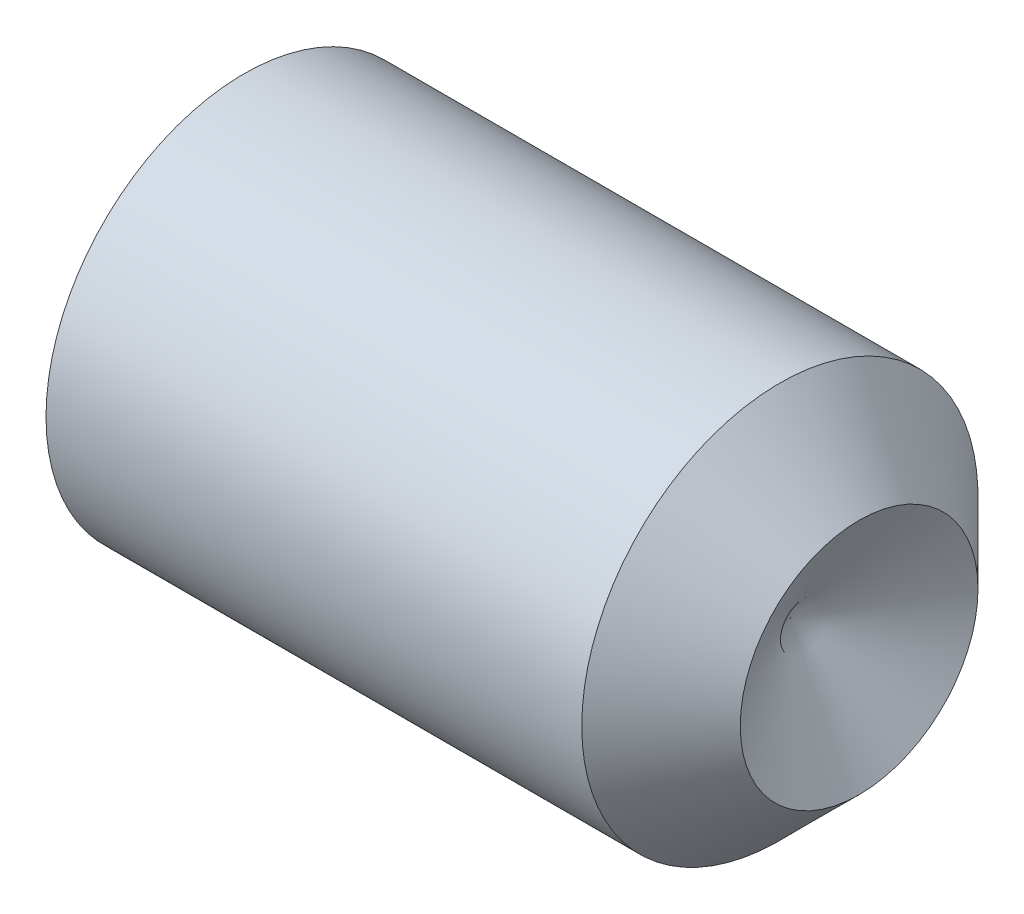
ISO-10303-21;
HEADER;
FILE_DESCRIPTION(('STEP AP214'),'2;1');
FILE_NAME('part.step','',(''),(''),'','','');
FILE_SCHEMA(('AUTOMOTIVE_DESIGN { 1 0 10303 214 1 1 1 1 }'));
ENDSEC;
DATA;
#1=APPLICATION_CONTEXT('core data for automotive mechanical design processes');
#2=APPLICATION_PROTOCOL_DEFINITION('international standard','automotive_design',2000,#1);
#3=PRODUCT_CONTEXT('',#1,'mechanical');
#4=PRODUCT('Part','Part','',(#3));
#5=PRODUCT_RELATED_PRODUCT_CATEGORY('part','',(#4));
#6=PRODUCT_DEFINITION_FORMATION('','',#4);
#7=PRODUCT_DEFINITION_CONTEXT('part definition',#1,'design');
#8=PRODUCT_DEFINITION('design','',#6,#7);
#9=PRODUCT_DEFINITION_SHAPE('','',#8);
#10=(LENGTH_UNIT() NAMED_UNIT(*) SI_UNIT(.MILLI.,.METRE.));
#11=(NAMED_UNIT(*) PLANE_ANGLE_UNIT() SI_UNIT($,.RADIAN.));
#12=(NAMED_UNIT(*) SI_UNIT($,.STERADIAN.) SOLID_ANGLE_UNIT());
#13=UNCERTAINTY_MEASURE_WITH_UNIT(LENGTH_MEASURE(1.E-05),#10,'distance_accuracy_value','');
#14=(GEOMETRIC_REPRESENTATION_CONTEXT(3) GLOBAL_UNCERTAINTY_ASSIGNED_CONTEXT((#13)) GLOBAL_UNIT_ASSIGNED_CONTEXT((#10,
#11,#12)) REPRESENTATION_CONTEXT('',''));
#15=CARTESIAN_POINT('',(0.,0.,0.));
#16=DIRECTION('',(0.,0.,1.));
#17=DIRECTION('',(1.,0.,0.));
#18=AXIS2_PLACEMENT_3D('',#15,#16,#17);
#19=CARTESIAN_POINT('',(0.,0.,0.));
#20=DIRECTION('',(-1.,0.,0.));
#21=DIRECTION('',(0.,0.,1.));
#22=AXIS2_PLACEMENT_3D('',#19,#20,#21);
#23=PLANE('',#22);
#24=CARTESIAN_POINT('',(0.,0.,0.));
#25=DIRECTION('',(-1.,0.,0.));
#26=DIRECTION('',(0.,0.,1.));
#27=AXIS2_PLACEMENT_3D('',#24,#25,#26);
#28=CIRCLE('',#27,4.172);
#29=CARTESIAN_POINT('',(0.,0.,4.172));
#30=VERTEX_POINT('',#29);
#31=EDGE_CURVE('E11',#30,#30,#28,.T.);
#32=ORIENTED_EDGE('',*,*,#31,.T.);
#33=EDGE_LOOP('',(#32));
#34=FACE_BOUND('',#33,.T.);
#35=DIRECTION('',(0.,0.,-1.));
#36=VECTOR('',#35,1.);
#37=CARTESIAN_POINT('',(0.,2.5,1.44337567297406));
#38=LINE('',#37,#36);
#39=CARTESIAN_POINT('',(0.,2.5,1.44337567297406));
#40=VERTEX_POINT('',#39);
#41=CARTESIAN_POINT('',(0.,2.5,-1.44337567297407));
#42=VERTEX_POINT('',#41);
#43=EDGE_CURVE('E105',#40,#42,#38,.T.);
#44=ORIENTED_EDGE('',*,*,#43,.F.);
#45=DIRECTION('',(0.,-0.866025403784439,0.5));
#46=VECTOR('',#45,1.);
#47=CARTESIAN_POINT('',(0.,2.5,1.44337567297406));
#48=LINE('',#47,#46);
#49=CARTESIAN_POINT('',(0.,0.,2.88675134594813));
#50=VERTEX_POINT('',#49);
#51=EDGE_CURVE('E47',#40,#50,#48,.T.);
#52=ORIENTED_EDGE('',*,*,#51,.T.);
#53=DIRECTION('',(0.,0.866025403784439,0.5));
#54=VECTOR('',#53,1.);
#55=CARTESIAN_POINT('',(0.,-2.5,1.44337567297406));
#56=LINE('',#55,#54);
#57=CARTESIAN_POINT('',(0.,-2.5,1.44337567297406));
#58=VERTEX_POINT('',#57);
#59=EDGE_CURVE('E95',#58,#50,#56,.T.);
#60=ORIENTED_EDGE('',*,*,#59,.F.);
#61=DIRECTION('',(0.,0.,-1.));
#62=VECTOR('',#61,1.);
#63=CARTESIAN_POINT('',(0.,-2.5,1.44337567297406));
#64=LINE('',#63,#62);
#65=CARTESIAN_POINT('',(0.,-2.5,-1.44337567297407));
#66=VERTEX_POINT('',#65);
#67=EDGE_CURVE('E100',#58,#66,#64,.T.);
#68=ORIENTED_EDGE('',*,*,#67,.T.);
#69=DIRECTION('',(0.,0.866025403784439,-0.5));
#70=VECTOR('',#69,1.);
#71=CARTESIAN_POINT('',(0.,-2.5,-1.44337567297407));
#72=LINE('',#71,#70);
#73=CARTESIAN_POINT('',(0.,0.,-2.88675134594813));
#74=VERTEX_POINT('',#73);
#75=EDGE_CURVE('E109',#66,#74,#72,.T.);
#76=ORIENTED_EDGE('',*,*,#75,.T.);
#77=DIRECTION('',(0.,-0.866025403784438,-0.5));
#78=VECTOR('',#77,1.);
#79=CARTESIAN_POINT('',(0.,2.5,-1.44337567297407));
#80=LINE('',#79,#78);
#81=EDGE_CURVE('E112',#42,#74,#80,.T.);
#82=ORIENTED_EDGE('',*,*,#81,.F.);
#83=EDGE_LOOP('',(#44,#52,#60,#68,#76,#82));
#84=FACE_BOUND('',#83,.T.);
#85=ADVANCED_FACE('F33',(#34,#84),#23,.T.);
#86=CARTESIAN_POINT('',(0.,0.,0.));
#87=DIRECTION('',(1.,0.,0.));
#88=DIRECTION('',(0.,0.,-1.));
#89=AXIS2_PLACEMENT_3D('',#86,#87,#88);
#90=CONICAL_SURFACE('',#89,4.172,1.0471975511966);
#91=CARTESIAN_POINT('',(0.478046022889008,0.,0.));
#92=DIRECTION('',(-1.,0.,0.));
#93=DIRECTION('',(0.,0.,1.));
#94=AXIS2_PLACEMENT_3D('',#91,#92,#93);
#95=CIRCLE('',#94,5.);
#96=CARTESIAN_POINT('',(0.478046022889008,0.,5.));
#97=VERTEX_POINT('',#96);
#98=EDGE_CURVE('E40',#97,#97,#95,.T.);
#99=ORIENTED_EDGE('',*,*,#98,.T.);
#100=EDGE_LOOP('',(#99));
#101=FACE_BOUND('',#100,.T.);
#102=ORIENTED_EDGE('',*,*,#31,.F.);
#103=EDGE_LOOP('',(#102));
#104=FACE_BOUND('',#103,.T.);
#105=ADVANCED_FACE('F145',(#101,#104),#90,.T.);
#106=CARTESIAN_POINT('',(-12.7,0.,0.));
#107=DIRECTION('',(-1.,0.,0.));
#108=DIRECTION('',(0.,0.,1.));
#109=AXIS2_PLACEMENT_3D('',#106,#107,#108);
#110=CYLINDRICAL_SURFACE('',#109,5.);
#111=CARTESIAN_POINT('',(14.,0.,0.));
#112=DIRECTION('',(-1.,0.,0.));
#113=DIRECTION('',(0.,0.,1.));
#114=AXIS2_PLACEMENT_3D('',#111,#112,#113);
#115=CIRCLE('',#114,5.);
#116=CARTESIAN_POINT('',(14.,0.,5.));
#117=VERTEX_POINT('',#116);
#118=EDGE_CURVE('E140',#117,#117,#115,.T.);
#119=ORIENTED_EDGE('',*,*,#118,.T.);
#120=EDGE_LOOP('',(#119));
#121=FACE_BOUND('',#120,.T.);
#122=ORIENTED_EDGE('',*,*,#98,.F.);
#123=EDGE_LOOP('',(#122));
#124=FACE_BOUND('',#123,.T.);
#125=ADVANCED_FACE('F148',(#121,#124),#110,.T.);
#126=CARTESIAN_POINT('',(14.,0.,0.));
#127=DIRECTION('',(-1.,0.,0.));
#128=DIRECTION('',(0.,0.,1.));
#129=AXIS2_PLACEMENT_3D('',#126,#127,#128);
#130=CONICAL_SURFACE('',#129,5.,0.785398163397446);
#131=CARTESIAN_POINT('',(16.,0.,0.));
#132=DIRECTION('',(-1.,0.,0.));
#133=DIRECTION('',(0.,0.,1.));
#134=AXIS2_PLACEMENT_3D('',#131,#132,#133);
#135=CIRCLE('',#134,3.);
#136=CARTESIAN_POINT('',(16.,0.,3.));
#137=VERTEX_POINT('',#136);
#138=EDGE_CURVE('E91',#137,#137,#135,.T.);
#139=ORIENTED_EDGE('',*,*,#138,.T.);
#140=EDGE_LOOP('',(#139));
#141=FACE_BOUND('',#140,.T.);
#142=ORIENTED_EDGE('',*,*,#118,.F.);
#143=EDGE_LOOP('',(#142));
#144=FACE_BOUND('',#143,.T.);
#145=ADVANCED_FACE('F150',(#141,#144),#130,.T.);
#146=CARTESIAN_POINT('',(14.2679491924311,0.,0.));
#147=DIRECTION('',(1.,0.,0.));
#148=DIRECTION('',(0.,0.,-1.));
#149=AXIS2_PLACEMENT_3D('',#146,#147,#148);
#150=CONICAL_SURFACE('',#149,0.,1.0471975511966);
#151=ORIENTED_EDGE('',*,*,#138,.F.);
#152=EDGE_LOOP('',(#151));
#153=FACE_BOUND('',#152,.T.);
#154=CARTESIAN_POINT('',(14.2679491924311,0.,0.));
#155=VERTEX_POINT('',#154);
#156=VERTEX_LOOP('',#155);
#157=FACE_BOUND('',#156,.T.);
#158=ADVANCED_FACE('F157',(#153,#157),#150,.F.);
#159=CARTESIAN_POINT('',(6.,2.5,1.44337567297406));
#160=DIRECTION('',(0.,-0.5,-0.866025403784439));
#161=DIRECTION('',(0.,0.866025403784439,-0.5));
#162=AXIS2_PLACEMENT_3D('',#159,#160,#161);
#163=PLANE('',#162);
#164=ORIENTED_EDGE('',*,*,#51,.F.);
#165=DIRECTION('',(-1.,0.,0.));
#166=VECTOR('',#165,1.);
#167=CARTESIAN_POINT('',(6.,2.5,1.44337567297406));
#168=LINE('',#167,#166);
#169=CARTESIAN_POINT('',(6.,2.5,1.44337567297406));
#170=VERTEX_POINT('',#169);
#171=EDGE_CURVE('E129',#170,#40,#168,.T.);
#172=ORIENTED_EDGE('',*,*,#171,.F.);
#173=DIRECTION('',(0.,-0.866025403784439,0.5));
#174=VECTOR('',#173,1.);
#175=CARTESIAN_POINT('',(6.,2.5,1.44337567297406));
#176=LINE('',#175,#174);
#177=CARTESIAN_POINT('',(6.,0.,2.88675134594813));
#178=VERTEX_POINT('',#177);
#179=EDGE_CURVE('E87',#170,#178,#176,.T.);
#180=ORIENTED_EDGE('',*,*,#179,.T.);
#181=DIRECTION('',(-1.,0.,0.));
#182=VECTOR('',#181,1.);
#183=CARTESIAN_POINT('',(6.,0.,2.88675134594813));
#184=LINE('',#183,#182);
#185=EDGE_CURVE('E83',#178,#50,#184,.T.);
#186=ORIENTED_EDGE('',*,*,#185,.T.);
#187=EDGE_LOOP('',(#164,#172,#180,#186));
#188=FACE_BOUND('',#187,.T.);
#189=ADVANCED_FACE('F85',(#188),#163,.T.);
#190=CARTESIAN_POINT('',(6.,-2.5,1.44337567297406));
#191=DIRECTION('',(0.,-0.5,0.866025403784439));
#192=DIRECTION('',(0.,-0.866025403784439,-0.5));
#193=AXIS2_PLACEMENT_3D('',#190,#191,#192);
#194=PLANE('',#193);
#195=ORIENTED_EDGE('',*,*,#59,.T.);
#196=ORIENTED_EDGE('',*,*,#185,.F.);
#197=DIRECTION('',(0.,0.866025403784439,0.5));
#198=VECTOR('',#197,1.);
#199=CARTESIAN_POINT('',(6.,-2.5,1.44337567297406));
#200=LINE('',#199,#198);
#201=CARTESIAN_POINT('',(6.,-2.5,1.44337567297406));
#202=VERTEX_POINT('',#201);
#203=EDGE_CURVE('E117',#202,#178,#200,.T.);
#204=ORIENTED_EDGE('',*,*,#203,.F.);
#205=DIRECTION('',(-1.,0.,0.));
#206=VECTOR('',#205,1.);
#207=CARTESIAN_POINT('',(6.,-2.5,1.44337567297406));
#208=LINE('',#207,#206);
#209=EDGE_CURVE('E92',#202,#58,#208,.T.);
#210=ORIENTED_EDGE('',*,*,#209,.T.);
#211=EDGE_LOOP('',(#195,#196,#204,#210));
#212=FACE_BOUND('',#211,.T.);
#213=ADVANCED_FACE('F96',(#212),#194,.F.);
#214=CARTESIAN_POINT('',(6.,-2.5,1.44337567297406));
#215=DIRECTION('',(0.,1.,0.));
#216=DIRECTION('',(0.,0.,1.));
#217=AXIS2_PLACEMENT_3D('',#214,#215,#216);
#218=PLANE('',#217);
#219=ORIENTED_EDGE('',*,*,#67,.F.);
#220=ORIENTED_EDGE('',*,*,#209,.F.);
#221=DIRECTION('',(0.,0.,-1.));
#222=VECTOR('',#221,1.);
#223=CARTESIAN_POINT('',(6.,-2.5,1.44337567297406));
#224=LINE('',#223,#222);
#225=CARTESIAN_POINT('',(6.,-2.5,-1.44337567297407));
#226=VERTEX_POINT('',#225);
#227=EDGE_CURVE('E119',#202,#226,#224,.T.);
#228=ORIENTED_EDGE('',*,*,#227,.T.);
#229=DIRECTION('',(-1.,0.,0.));
#230=VECTOR('',#229,1.);
#231=CARTESIAN_POINT('',(6.,-2.5,-1.44337567297407));
#232=LINE('',#231,#230);
#233=EDGE_CURVE('E135',#226,#66,#232,.T.);
#234=ORIENTED_EDGE('',*,*,#233,.T.);
#235=EDGE_LOOP('',(#219,#220,#228,#234));
#236=FACE_BOUND('',#235,.T.);
#237=ADVANCED_FACE('F202',(#236),#218,.T.);
#238=CARTESIAN_POINT('',(6.,-2.5,-1.44337567297407));
#239=DIRECTION('',(0.,0.5,0.866025403784438));
#240=DIRECTION('',(0.,-0.866025403784439,0.5));
#241=AXIS2_PLACEMENT_3D('',#238,#239,#240);
#242=PLANE('',#241);
#243=ORIENTED_EDGE('',*,*,#75,.F.);
#244=ORIENTED_EDGE('',*,*,#233,.F.);
#245=DIRECTION('',(0.,0.866025403784439,-0.5));
#246=VECTOR('',#245,1.);
#247=CARTESIAN_POINT('',(6.,-2.5,-1.44337567297407));
#248=LINE('',#247,#246);
#249=CARTESIAN_POINT('',(6.,0.,-2.88675134594813));
#250=VERTEX_POINT('',#249);
#251=EDGE_CURVE('E121',#226,#250,#248,.T.);
#252=ORIENTED_EDGE('',*,*,#251,.T.);
#253=DIRECTION('',(-1.,0.,0.));
#254=VECTOR('',#253,1.);
#255=CARTESIAN_POINT('',(6.,0.,-2.88675134594813));
#256=LINE('',#255,#254);
#257=EDGE_CURVE('E133',#250,#74,#256,.T.);
#258=ORIENTED_EDGE('',*,*,#257,.T.);
#259=EDGE_LOOP('',(#243,#244,#252,#258));
#260=FACE_BOUND('',#259,.T.);
#261=ADVANCED_FACE('F209',(#260),#242,.T.);
#262=CARTESIAN_POINT('',(6.,2.5,-1.44337567297407));
#263=DIRECTION('',(0.,0.5,-0.866025403784439));
#264=DIRECTION('',(0.,0.866025403784439,0.5));
#265=AXIS2_PLACEMENT_3D('',#262,#263,#264);
#266=PLANE('',#265);
#267=ORIENTED_EDGE('',*,*,#81,.T.);
#268=ORIENTED_EDGE('',*,*,#257,.F.);
#269=DIRECTION('',(0.,-0.866025403784438,-0.5));
#270=VECTOR('',#269,1.);
#271=CARTESIAN_POINT('',(6.,2.5,-1.44337567297407));
#272=LINE('',#271,#270);
#273=CARTESIAN_POINT('',(6.,2.5,-1.44337567297407));
#274=VERTEX_POINT('',#273);
#275=EDGE_CURVE('E123',#274,#250,#272,.T.);
#276=ORIENTED_EDGE('',*,*,#275,.F.);
#277=DIRECTION('',(-1.,0.,0.));
#278=VECTOR('',#277,1.);
#279=CARTESIAN_POINT('',(6.,2.5,-1.44337567297407));
#280=LINE('',#279,#278);
#281=EDGE_CURVE('E131',#274,#42,#280,.T.);
#282=ORIENTED_EDGE('',*,*,#281,.T.);
#283=EDGE_LOOP('',(#267,#268,#276,#282));
#284=FACE_BOUND('',#283,.T.);
#285=ADVANCED_FACE('F217',(#284),#266,.F.);
#286=CARTESIAN_POINT('',(6.,2.5,1.44337567297406));
#287=DIRECTION('',(0.,1.,0.));
#288=DIRECTION('',(0.,0.,1.));
#289=AXIS2_PLACEMENT_3D('',#286,#287,#288);
#290=PLANE('',#289);
#291=ORIENTED_EDGE('',*,*,#43,.T.);
#292=ORIENTED_EDGE('',*,*,#281,.F.);
#293=DIRECTION('',(0.,0.,-1.));
#294=VECTOR('',#293,1.);
#295=CARTESIAN_POINT('',(6.,2.5,1.44337567297406));
#296=LINE('',#295,#294);
#297=EDGE_CURVE('E126',#170,#274,#296,.T.);
#298=ORIENTED_EDGE('',*,*,#297,.F.);
#299=ORIENTED_EDGE('',*,*,#171,.T.);
#300=EDGE_LOOP('',(#291,#292,#298,#299));
#301=FACE_BOUND('',#300,.T.);
#302=ADVANCED_FACE('F225',(#301),#290,.F.);
#303=CARTESIAN_POINT('',(6.,2.5,1.44337567297406));
#304=DIRECTION('',(1.,0.,0.));
#305=DIRECTION('',(0.,0.,-1.));
#306=AXIS2_PLACEMENT_3D('',#303,#304,#305);
#307=PLANE('',#306);
#308=ORIENTED_EDGE('',*,*,#179,.F.);
#309=ORIENTED_EDGE('',*,*,#297,.T.);
#310=ORIENTED_EDGE('',*,*,#275,.T.);
#311=ORIENTED_EDGE('',*,*,#251,.F.);
#312=ORIENTED_EDGE('',*,*,#227,.F.);
#313=ORIENTED_EDGE('',*,*,#203,.T.);
#314=EDGE_LOOP('',(#308,#309,#310,#311,#312,#313));
#315=FACE_BOUND('',#314,.T.);
#316=ADVANCED_FACE('F233',(#315),#307,.F.);
#317=CLOSED_SHELL('',(#85,#105,#125,#145,#158,#189,#213,#237,#261,#285,#302,#316));
#318=MANIFOLD_SOLID_BREP('B2',#317);
#319=ADVANCED_BREP_SHAPE_REPRESENTATION('',(#18,#318),#14);
#320=SHAPE_DEFINITION_REPRESENTATION(#9,#319);
ENDSEC;
END-ISO-10303-21;
